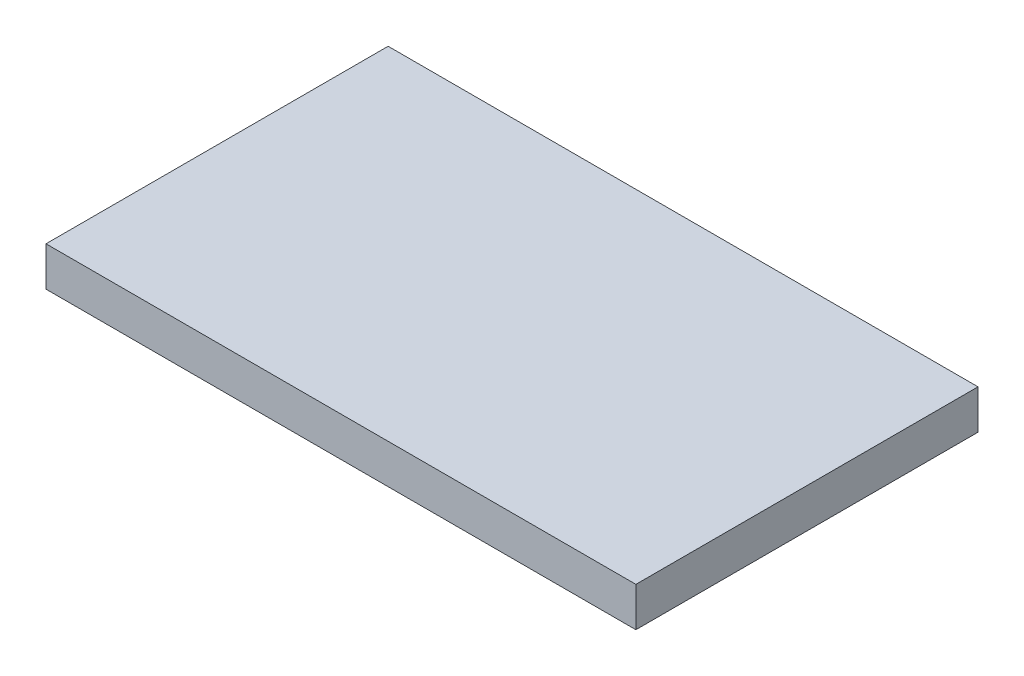
ISO-10303-21;
HEADER;
FILE_DESCRIPTION(('STEP AP214'),'2;1');
FILE_NAME('part.step','',(''),(''),'','','');
FILE_SCHEMA(('AUTOMOTIVE_DESIGN { 1 0 10303 214 1 1 1 1 }'));
ENDSEC;
DATA;
#1=APPLICATION_CONTEXT('core data for automotive mechanical design processes');
#2=APPLICATION_PROTOCOL_DEFINITION('international standard','automotive_design',2000,#1);
#3=PRODUCT_CONTEXT('',#1,'mechanical');
#4=PRODUCT('Part','Part','',(#3));
#5=PRODUCT_RELATED_PRODUCT_CATEGORY('part','',(#4));
#6=PRODUCT_DEFINITION_FORMATION('','',#4);
#7=PRODUCT_DEFINITION_CONTEXT('part definition',#1,'design');
#8=PRODUCT_DEFINITION('design','',#6,#7);
#9=PRODUCT_DEFINITION_SHAPE('','',#8);
#10=(LENGTH_UNIT() NAMED_UNIT(*) SI_UNIT(.MILLI.,.METRE.));
#11=(NAMED_UNIT(*) PLANE_ANGLE_UNIT() SI_UNIT($,.RADIAN.));
#12=(NAMED_UNIT(*) SI_UNIT($,.STERADIAN.) SOLID_ANGLE_UNIT());
#13=UNCERTAINTY_MEASURE_WITH_UNIT(LENGTH_MEASURE(1.E-05),#10,'distance_accuracy_value','');
#14=(GEOMETRIC_REPRESENTATION_CONTEXT(3) GLOBAL_UNCERTAINTY_ASSIGNED_CONTEXT((#13)) GLOBAL_UNIT_ASSIGNED_CONTEXT((#10,
#11,#12)) REPRESENTATION_CONTEXT('',''));
#15=CARTESIAN_POINT('',(0.,0.,0.));
#16=DIRECTION('',(0.,0.,1.));
#17=DIRECTION('',(1.,0.,0.));
#18=AXIS2_PLACEMENT_3D('',#15,#16,#17);
#19=CARTESIAN_POINT('',(0.,2.54,0.));
#20=DIRECTION('',(1.,0.,0.));
#21=DIRECTION('',(0.,0.,-1.));
#22=AXIS2_PLACEMENT_3D('',#19,#20,#21);
#23=PLANE('',#22);
#24=DIRECTION('',(0.,0.,1.));
#25=VECTOR('',#24,1.);
#26=CARTESIAN_POINT('',(0.,0.,0.));
#27=LINE('',#26,#25);
#28=CARTESIAN_POINT('',(0.,0.,-22.098));
#29=VERTEX_POINT('',#28);
#30=CARTESIAN_POINT('',(0.,0.,0.));
#31=VERTEX_POINT('',#30);
#32=EDGE_CURVE('E107',#29,#31,#27,.T.);
#33=ORIENTED_EDGE('',*,*,#32,.T.);
#34=DIRECTION('',(0.,-1.,0.));
#35=VECTOR('',#34,1.);
#36=CARTESIAN_POINT('',(0.,2.54,0.));
#37=LINE('',#36,#35);
#38=CARTESIAN_POINT('',(0.,2.54,0.));
#39=VERTEX_POINT('',#38);
#40=EDGE_CURVE('E11',#39,#31,#37,.T.);
#41=ORIENTED_EDGE('',*,*,#40,.F.);
#42=DIRECTION('',(0.,0.,1.));
#43=VECTOR('',#42,1.);
#44=CARTESIAN_POINT('',(0.,2.54,0.));
#45=LINE('',#44,#43);
#46=CARTESIAN_POINT('',(0.,2.54,-22.098));
#47=VERTEX_POINT('',#46);
#48=EDGE_CURVE('E91',#47,#39,#45,.T.);
#49=ORIENTED_EDGE('',*,*,#48,.F.);
#50=DIRECTION('',(0.,-1.,0.));
#51=VECTOR('',#50,1.);
#52=CARTESIAN_POINT('',(0.,2.54,-22.098));
#53=LINE('',#52,#51);
#54=EDGE_CURVE('E103',#47,#29,#53,.T.);
#55=ORIENTED_EDGE('',*,*,#54,.T.);
#56=EDGE_LOOP('',(#33,#41,#49,#55));
#57=FACE_BOUND('',#56,.T.);
#58=ADVANCED_FACE('F39',(#57),#23,.F.);
#59=CARTESIAN_POINT('',(0.,2.54,0.));
#60=DIRECTION('',(0.,0.,-1.));
#61=DIRECTION('',(-1.,0.,0.));
#62=AXIS2_PLACEMENT_3D('',#59,#60,#61);
#63=PLANE('',#62);
#64=DIRECTION('',(1.,0.,0.));
#65=VECTOR('',#64,1.);
#66=CARTESIAN_POINT('',(0.,0.,0.));
#67=LINE('',#66,#65);
#68=CARTESIAN_POINT('',(38.1,0.,0.));
#69=VERTEX_POINT('',#68);
#70=EDGE_CURVE('E96',#31,#69,#67,.T.);
#71=ORIENTED_EDGE('',*,*,#70,.T.);
#72=DIRECTION('',(0.,-1.,0.));
#73=VECTOR('',#72,1.);
#74=CARTESIAN_POINT('',(38.1,2.54,0.));
#75=LINE('',#74,#73);
#76=CARTESIAN_POINT('',(38.1,2.54,0.));
#77=VERTEX_POINT('',#76);
#78=EDGE_CURVE('E48',#77,#69,#75,.T.);
#79=ORIENTED_EDGE('',*,*,#78,.F.);
#80=DIRECTION('',(1.,0.,0.));
#81=VECTOR('',#80,1.);
#82=CARTESIAN_POINT('',(0.,2.54,0.));
#83=LINE('',#82,#81);
#84=EDGE_CURVE('E86',#39,#77,#83,.T.);
#85=ORIENTED_EDGE('',*,*,#84,.F.);
#86=ORIENTED_EDGE('',*,*,#40,.T.);
#87=EDGE_LOOP('',(#71,#79,#85,#86));
#88=FACE_BOUND('',#87,.T.);
#89=ADVANCED_FACE('F95',(#88),#63,.F.);
#90=CARTESIAN_POINT('',(38.1,2.54,0.));
#91=DIRECTION('',(-1.,0.,0.));
#92=DIRECTION('',(0.,0.,1.));
#93=AXIS2_PLACEMENT_3D('',#90,#91,#92);
#94=PLANE('',#93);
#95=DIRECTION('',(0.,0.,-1.));
#96=VECTOR('',#95,1.);
#97=CARTESIAN_POINT('',(38.1,0.,0.));
#98=LINE('',#97,#96);
#99=CARTESIAN_POINT('',(38.1,0.,-22.098));
#100=VERTEX_POINT('',#99);
#101=EDGE_CURVE('E73',#69,#100,#98,.T.);
#102=ORIENTED_EDGE('',*,*,#101,.T.);
#103=DIRECTION('',(0.,-1.,0.));
#104=VECTOR('',#103,1.);
#105=CARTESIAN_POINT('',(38.1,2.54,-22.098));
#106=LINE('',#105,#104);
#107=CARTESIAN_POINT('',(38.1,2.54,-22.098));
#108=VERTEX_POINT('',#107);
#109=EDGE_CURVE('E98',#108,#100,#106,.T.);
#110=ORIENTED_EDGE('',*,*,#109,.F.);
#111=DIRECTION('',(0.,0.,-1.));
#112=VECTOR('',#111,1.);
#113=CARTESIAN_POINT('',(38.1,2.54,0.));
#114=LINE('',#113,#112);
#115=EDGE_CURVE('E89',#77,#108,#114,.T.);
#116=ORIENTED_EDGE('',*,*,#115,.F.);
#117=ORIENTED_EDGE('',*,*,#78,.T.);
#118=EDGE_LOOP('',(#102,#110,#116,#117));
#119=FACE_BOUND('',#118,.T.);
#120=ADVANCED_FACE('F99',(#119),#94,.F.);
#121=CARTESIAN_POINT('',(0.,2.54,-22.098));
#122=DIRECTION('',(0.,0.,1.));
#123=DIRECTION('',(1.,0.,0.));
#124=AXIS2_PLACEMENT_3D('',#121,#122,#123);
#125=PLANE('',#124);
#126=DIRECTION('',(-1.,0.,0.));
#127=VECTOR('',#126,1.);
#128=CARTESIAN_POINT('',(0.,0.,-22.098));
#129=LINE('',#128,#127);
#130=EDGE_CURVE('E79',#100,#29,#129,.T.);
#131=ORIENTED_EDGE('',*,*,#130,.T.);
#132=ORIENTED_EDGE('',*,*,#54,.F.);
#133=DIRECTION('',(-1.,0.,0.));
#134=VECTOR('',#133,1.);
#135=CARTESIAN_POINT('',(0.,2.54,-22.098));
#136=LINE('',#135,#134);
#137=EDGE_CURVE('E56',#108,#47,#136,.T.);
#138=ORIENTED_EDGE('',*,*,#137,.F.);
#139=ORIENTED_EDGE('',*,*,#109,.T.);
#140=EDGE_LOOP('',(#131,#132,#138,#139));
#141=FACE_BOUND('',#140,.T.);
#142=ADVANCED_FACE('F120',(#141),#125,.F.);
#143=CARTESIAN_POINT('',(0.,2.54,0.));
#144=DIRECTION('',(0.,-1.,0.));
#145=DIRECTION('',(0.,0.,-1.));
#146=AXIS2_PLACEMENT_3D('',#143,#144,#145);
#147=PLANE('',#146);
#148=ORIENTED_EDGE('',*,*,#48,.T.);
#149=ORIENTED_EDGE('',*,*,#84,.T.);
#150=ORIENTED_EDGE('',*,*,#115,.T.);
#151=ORIENTED_EDGE('',*,*,#137,.T.);
#152=EDGE_LOOP('',(#148,#149,#150,#151));
#153=FACE_BOUND('',#152,.T.);
#154=ADVANCED_FACE('F87',(#153),#147,.F.);
#155=CARTESIAN_POINT('',(0.,0.,0.));
#156=DIRECTION('',(0.,-1.,0.));
#157=DIRECTION('',(0.,0.,-1.));
#158=AXIS2_PLACEMENT_3D('',#155,#156,#157);
#159=PLANE('',#158);
#160=ORIENTED_EDGE('',*,*,#32,.F.);
#161=ORIENTED_EDGE('',*,*,#130,.F.);
#162=ORIENTED_EDGE('',*,*,#101,.F.);
#163=ORIENTED_EDGE('',*,*,#70,.F.);
#164=EDGE_LOOP('',(#160,#161,#162,#163));
#165=FACE_BOUND('',#164,.T.);
#166=ADVANCED_FACE('F123',(#165),#159,.T.);
#167=CLOSED_SHELL('',(#58,#89,#120,#142,#154,#166));
#168=MANIFOLD_SOLID_BREP('B2',#167);
#169=ADVANCED_BREP_SHAPE_REPRESENTATION('',(#18,#168),#14);
#170=SHAPE_DEFINITION_REPRESENTATION(#9,#169);
ENDSEC;
END-ISO-10303-21;
